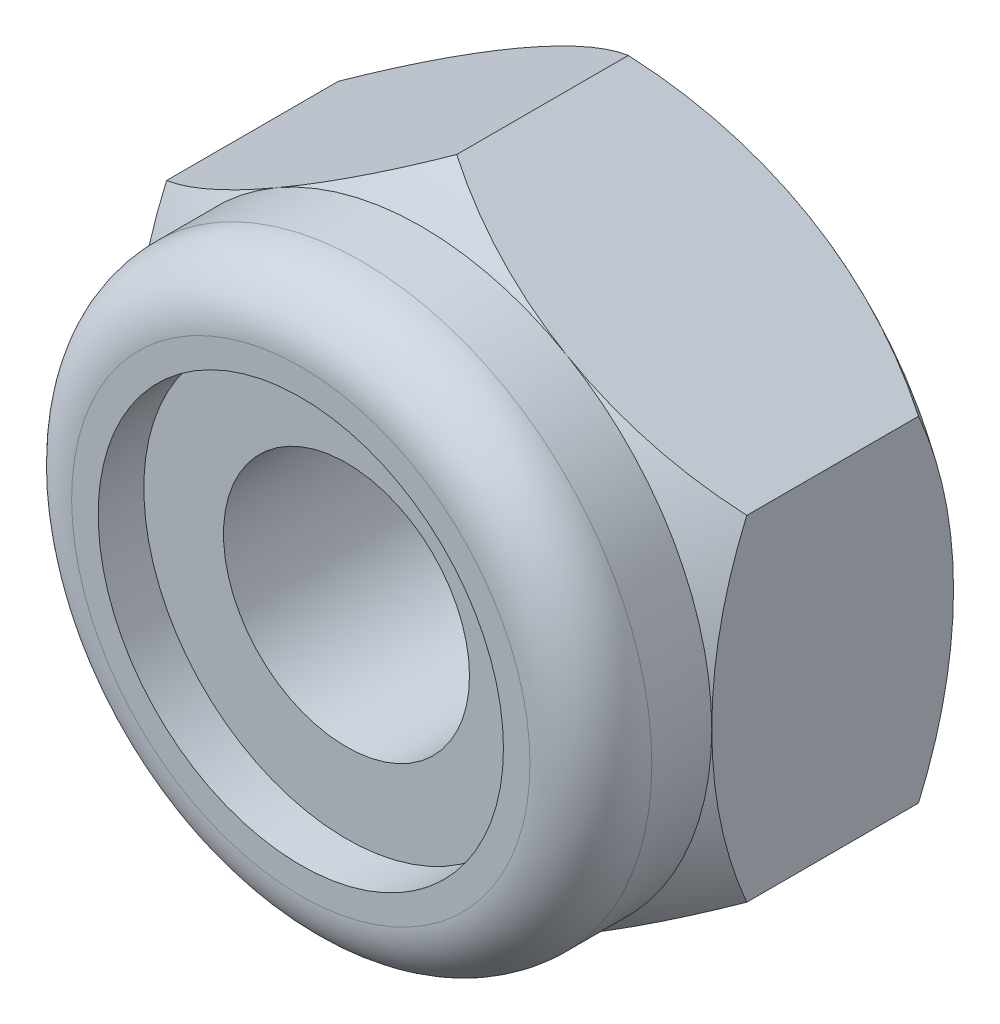
ISO-10303-21;
HEADER;
FILE_DESCRIPTION(('STEP AP214'),'2;1');
FILE_NAME('part.step','',(''),(''),'','','');
FILE_SCHEMA(('AUTOMOTIVE_DESIGN { 1 0 10303 214 1 1 1 1 }'));
ENDSEC;
DATA;
#1=APPLICATION_CONTEXT('core data for automotive mechanical design processes');
#2=APPLICATION_PROTOCOL_DEFINITION('international standard','automotive_design',2000,#1);
#3=PRODUCT_CONTEXT('',#1,'mechanical');
#4=PRODUCT('Part','Part','',(#3));
#5=PRODUCT_RELATED_PRODUCT_CATEGORY('part','',(#4));
#6=PRODUCT_DEFINITION_FORMATION('','',#4);
#7=PRODUCT_DEFINITION_CONTEXT('part definition',#1,'design');
#8=PRODUCT_DEFINITION('design','',#6,#7);
#9=PRODUCT_DEFINITION_SHAPE('','',#8);
#10=(LENGTH_UNIT() NAMED_UNIT(*) SI_UNIT(.MILLI.,.METRE.));
#11=(NAMED_UNIT(*) PLANE_ANGLE_UNIT() SI_UNIT($,.RADIAN.));
#12=(NAMED_UNIT(*) SI_UNIT($,.STERADIAN.) SOLID_ANGLE_UNIT());
#13=UNCERTAINTY_MEASURE_WITH_UNIT(LENGTH_MEASURE(1.E-05),#10,'distance_accuracy_value','');
#14=(GEOMETRIC_REPRESENTATION_CONTEXT(3) GLOBAL_UNCERTAINTY_ASSIGNED_CONTEXT((#13)) GLOBAL_UNIT_ASSIGNED_CONTEXT((#10,
#11,#12)) REPRESENTATION_CONTEXT('',''));
#15=CARTESIAN_POINT('',(0.,0.,0.));
#16=DIRECTION('',(0.,0.,1.));
#17=DIRECTION('',(1.,0.,0.));
#18=AXIS2_PLACEMENT_3D('',#15,#16,#17);
#19=CARTESIAN_POINT('',(0.,1.24344978758018E-11,4.95312499999961));
#20=DIRECTION('',(0.,0.,1.));
#21=DIRECTION('',(1.,0.,0.));
#22=AXIS2_PLACEMENT_3D('',#19,#20,#21);
#23=TOROIDAL_SURFACE('',#22,3.7625,1.);
#24=CARTESIAN_POINT('',(0.,1.24344978758018E-11,4.95312499999961));
#25=DIRECTION('',(0.,0.,-1.));
#26=DIRECTION('',(-1.,0.,0.));
#27=AXIS2_PLACEMENT_3D('',#24,#25,#26);
#28=CIRCLE('',#27,4.7625);
#29=CARTESIAN_POINT('',(-4.7625,1.24344978758018E-11,4.95312499999961));
#30=VERTEX_POINT('',#29);
#31=EDGE_CURVE('E159',#30,#30,#28,.T.);
#32=ORIENTED_EDGE('',*,*,#31,.F.);
#33=EDGE_LOOP('',(#32));
#34=FACE_BOUND('',#33,.T.);
#35=CARTESIAN_POINT('',(0.,1.24344978758018E-11,5.95312499999961));
#36=DIRECTION('',(0.,0.,-1.));
#37=DIRECTION('',(1.,0.,0.));
#38=AXIS2_PLACEMENT_3D('',#35,#36,#37);
#39=CIRCLE('',#38,3.7625);
#40=CARTESIAN_POINT('',(-3.7625,1.24349831420959E-11,5.95312499999961));
#41=VERTEX_POINT('',#40);
#42=CARTESIAN_POINT('',(3.7625,1.24344978758018E-11,5.95312499999961));
#43=VERTEX_POINT('',#42);
#44=EDGE_CURVE('E167',#41,#43,#39,.F.);
#45=ORIENTED_EDGE('',*,*,#44,.F.);
#46=CARTESIAN_POINT('',(0.,1.24344978758018E-11,5.95312499999961));
#47=DIRECTION('',(0.,0.,-1.));
#48=DIRECTION('',(-1.,0.,0.));
#49=AXIS2_PLACEMENT_3D('',#46,#47,#48);
#50=CIRCLE('',#49,3.7625);
#51=EDGE_CURVE('E165',#43,#41,#50,.F.);
#52=ORIENTED_EDGE('',*,*,#51,.F.);
#53=EDGE_LOOP('',(#45,#52));
#54=FACE_BOUND('',#53,.T.);
#55=ADVANCED_FACE('F14',(#34,#54),#23,.T.);
#56=CARTESIAN_POINT('',(0.,1.24344978758018E-11,5.95312499999961));
#57=DIRECTION('',(0.,0.,1.));
#58=DIRECTION('',(1.,0.,0.));
#59=AXIS2_PLACEMENT_3D('',#56,#57,#58);
#60=PLANE('',#59);
#61=CARTESIAN_POINT('',(0.,1.24344978758018E-11,5.95312499999961));
#62=DIRECTION('',(0.,0.,1.));
#63=DIRECTION('',(1.,0.,0.));
#64=AXIS2_PLACEMENT_3D('',#61,#62,#63);
#65=CIRCLE('',#64,3.32676299779793);
#66=CARTESIAN_POINT('',(3.32676299779793,1.24344978758018E-11,5.95312499999961));
#67=VERTEX_POINT('',#66);
#68=EDGE_CURVE('E126',#67,#67,#65,.F.);
#69=ORIENTED_EDGE('',*,*,#68,.T.);
#70=EDGE_LOOP('',(#69));
#71=FACE_BOUND('',#70,.T.);
#72=ORIENTED_EDGE('',*,*,#51,.T.);
#73=ORIENTED_EDGE('',*,*,#44,.T.);
#74=EDGE_LOOP('',(#72,#73));
#75=FACE_BOUND('',#74,.T.);
#76=ADVANCED_FACE('F173',(#71,#75),#60,.T.);
#77=CARTESIAN_POINT('',(0.,1.24344978758018E-11,5.95312499999961));
#78=DIRECTION('',(0.,0.,-1.));
#79=DIRECTION('',(-1.,0.,0.));
#80=AXIS2_PLACEMENT_3D('',#77,#78,#79);
#81=CYLINDRICAL_SURFACE('',#80,4.7625);
#82=ORIENTED_EDGE('',*,*,#31,.T.);
#83=EDGE_LOOP('',(#82));
#84=FACE_BOUND('',#83,.T.);
#85=CARTESIAN_POINT('',(0.,1.24344978758018E-11,3.96875000000001));
#86=DIRECTION('',(0.,0.,-1.));
#87=DIRECTION('',(-1.,0.,0.));
#88=AXIS2_PLACEMENT_3D('',#85,#86,#87);
#89=CIRCLE('',#88,4.7625);
#90=CARTESIAN_POINT('',(2.3812499999973,-4.12444598551874,3.96875));
#91=VERTEX_POINT('',#90);
#92=CARTESIAN_POINT('',(-2.3812499999973,-4.12444598551874,3.96875000000001));
#93=VERTEX_POINT('',#92);
#94=EDGE_CURVE('E108',#91,#93,#89,.T.);
#95=ORIENTED_EDGE('',*,*,#94,.F.);
#96=CARTESIAN_POINT('',(0.,1.24344978758018E-11,3.96875000000001));
#97=DIRECTION('',(0.,0.,-1.));
#98=DIRECTION('',(-1.,0.,0.));
#99=AXIS2_PLACEMENT_3D('',#96,#97,#98);
#100=CIRCLE('',#99,4.7625);
#101=CARTESIAN_POINT('',(4.76249999999073,3.10946746982632E-12,3.96875000000644));
#102=VERTEX_POINT('',#101);
#103=EDGE_CURVE('E149',#102,#91,#100,.T.);
#104=ORIENTED_EDGE('',*,*,#103,.F.);
#105=CARTESIAN_POINT('',(0.,1.24344978758018E-11,3.96875000000001));
#106=DIRECTION('',(0.,0.,-1.));
#107=DIRECTION('',(-1.,0.,0.));
#108=AXIS2_PLACEMENT_3D('',#105,#106,#107);
#109=CIRCLE('',#108,4.7625);
#110=CARTESIAN_POINT('',(2.38125000000269,4.12444598552807,3.96875));
#111=VERTEX_POINT('',#110);
#112=EDGE_CURVE('E151',#111,#102,#109,.T.);
#113=ORIENTED_EDGE('',*,*,#112,.F.);
#114=CARTESIAN_POINT('',(0.,1.24344978758018E-11,3.96874999999923));
#115=DIRECTION('',(0.,0.,-1.));
#116=DIRECTION('',(-1.,0.,0.));
#117=AXIS2_PLACEMENT_3D('',#114,#115,#116);
#118=CIRCLE('',#117,4.7625);
#119=CARTESIAN_POINT('',(-2.38125000000269,4.12444598552807,3.96874999999961));
#120=VERTEX_POINT('',#119);
#121=EDGE_CURVE('E154',#120,#111,#118,.T.);
#122=ORIENTED_EDGE('',*,*,#121,.F.);
#123=CARTESIAN_POINT('',(0.,1.24344978758018E-11,3.96874999999923));
#124=DIRECTION('',(0.,0.,-1.));
#125=DIRECTION('',(-1.,0.,0.));
#126=AXIS2_PLACEMENT_3D('',#123,#124,#125);
#127=CIRCLE('',#126,4.7625);
#128=CARTESIAN_POINT('',(-4.7624999999909,6.21720651084527E-12,3.96875000000634));
#129=VERTEX_POINT('',#128);
#130=EDGE_CURVE('E111',#129,#120,#127,.T.);
#131=ORIENTED_EDGE('',*,*,#130,.F.);
#132=CARTESIAN_POINT('',(0.,1.24344978758018E-11,3.96875000000001));
#133=DIRECTION('',(0.,0.,-1.));
#134=DIRECTION('',(-1.,0.,0.));
#135=AXIS2_PLACEMENT_3D('',#132,#133,#134);
#136=CIRCLE('',#135,4.7625);
#137=EDGE_CURVE('E105',#93,#129,#136,.T.);
#138=ORIENTED_EDGE('',*,*,#137,.F.);
#139=EDGE_LOOP('',(#95,#104,#113,#122,#131,#138));
#140=FACE_BOUND('',#139,.T.);
#141=ADVANCED_FACE('F107',(#84,#140),#81,.T.);
#142=CARTESIAN_POINT('',(0.,1.24344978758018E-11,5.95312499999961));
#143=DIRECTION('',(0.,0.,1.));
#144=DIRECTION('',(1.,0.,0.));
#145=AXIS2_PLACEMENT_3D('',#142,#143,#144);
#146=CYLINDRICAL_SURFACE('',#145,3.32676299779793);
#147=CARTESIAN_POINT('',(0.,1.24344978758018E-11,5.20312499999961));
#148=DIRECTION('',(0.,0.,1.));
#149=DIRECTION('',(1.,0.,0.));
#150=AXIS2_PLACEMENT_3D('',#147,#148,#149);
#151=CIRCLE('',#150,3.32676299779793);
#152=CARTESIAN_POINT('',(3.32676299779793,1.24344978758018E-11,5.20312499999961));
#153=VERTEX_POINT('',#152);
#154=EDGE_CURVE('E146',#153,#153,#151,.F.);
#155=ORIENTED_EDGE('',*,*,#154,.T.);
#156=EDGE_LOOP('',(#155));
#157=FACE_BOUND('',#156,.T.);
#158=ORIENTED_EDGE('',*,*,#68,.F.);
#159=EDGE_LOOP('',(#158));
#160=FACE_BOUND('',#159,.T.);
#161=ADVANCED_FACE('F293',(#157,#160),#146,.F.);
#162=CARTESIAN_POINT('',(0.,0.,-2.89662617308755));
#163=DIRECTION('',(1.,0.,0.));
#164=DIRECTION('',(0.,-0.514062280042827,0.857752861981334));
#165=AXIS2_PLACEMENT_3D('',#162,#163,#164);
#166=SPHERICAL_SURFACE('',#165,8.35552489362568);
#167=CARTESIAN_POINT('',(2.38125000000001,-4.12444598552341,-2.89662617308755));
#168=DIRECTION('',(0.5,-0.866025403784439,0.));
#169=DIRECTION('',(0.866025403784439,0.5,0.));
#170=AXIS2_PLACEMENT_3D('',#167,#168,#169);
#171=CIRCLE('',#170,6.86537617308755);
#172=CARTESIAN_POINT('',(3.73850256307762E-11,-5.4992613140528,3.39407499989474));
#173=VERTEX_POINT('',#172);
#174=EDGE_CURVE('E124',#91,#173,#171,.T.);
#175=ORIENTED_EDGE('',*,*,#174,.F.);
#176=ORIENTED_EDGE('',*,*,#94,.T.);
#177=CARTESIAN_POINT('',(-2.38125000000001,-4.12444598552341,-2.89662617308755));
#178=DIRECTION('',(-0.5,-0.866025403784439,0.));
#179=DIRECTION('',(0.866025403784439,-0.5,0.));
#180=AXIS2_PLACEMENT_3D('',#177,#178,#179);
#181=CIRCLE('',#180,6.86537617308755);
#182=EDGE_CURVE('E122',#173,#93,#181,.T.);
#183=ORIENTED_EDGE('',*,*,#182,.F.);
#184=EDGE_LOOP('',(#175,#176,#183));
#185=FACE_BOUND('',#184,.T.);
#186=ADVANCED_FACE('F120',(#185),#166,.T.);
#187=CARTESIAN_POINT('',(0.,0.,-2.89662617308763));
#188=DIRECTION('',(1.,0.,0.));
#189=DIRECTION('',(0.,0.0032458647859938,0.999994732167021));
#190=AXIS2_PLACEMENT_3D('',#187,#188,#189);
#191=SPHERICAL_SURFACE('',#190,8.35552489362576);
#192=CARTESIAN_POINT('',(-2.38124999999998,-4.12444598552343,-2.89662617308763));
#193=DIRECTION('',(-0.5,-0.866025403784439,0.));
#194=DIRECTION('',(0.866025403784439,-0.5,0.));
#195=AXIS2_PLACEMENT_3D('',#192,#193,#194);
#196=CIRCLE('',#195,6.86537617308764);
#197=CARTESIAN_POINT('',(-4.7625,-2.74963065700324,3.39407499991903));
#198=VERTEX_POINT('',#197);
#199=EDGE_CURVE('E128',#93,#198,#196,.T.);
#200=ORIENTED_EDGE('',*,*,#199,.F.);
#201=ORIENTED_EDGE('',*,*,#137,.T.);
#202=CARTESIAN_POINT('',(-4.7625,0.,-2.89662617308763));
#203=DIRECTION('',(1.,0.,0.));
#204=DIRECTION('',(0.,0.,-1.));
#205=AXIS2_PLACEMENT_3D('',#202,#203,#204);
#206=CIRCLE('',#205,6.86537617308764);
#207=EDGE_CURVE('E131',#198,#129,#206,.F.);
#208=ORIENTED_EDGE('',*,*,#207,.F.);
#209=EDGE_LOOP('',(#200,#201,#208));
#210=FACE_BOUND('',#209,.T.);
#211=ADVANCED_FACE('F129',(#210),#191,.T.);
#212=CARTESIAN_POINT('',(0.,0.,-2.89662617308756));
#213=DIRECTION('',(1.,0.,0.));
#214=DIRECTION('',(0.,0.517754599312731,0.855529178281205));
#215=AXIS2_PLACEMENT_3D('',#212,#213,#214);
#216=SPHERICAL_SURFACE('',#215,8.3555248936257);
#217=CARTESIAN_POINT('',(-4.76249999998179,0.,-2.89662617308756));
#218=DIRECTION('',(1.,0.,0.));
#219=DIRECTION('',(0.,0.,-1.));
#220=AXIS2_PLACEMENT_3D('',#217,#218,#219);
#221=CIRCLE('',#220,6.86537617310022);
#222=CARTESIAN_POINT('',(-4.76249999994811,2.74963065704558,3.39407499993981));
#223=VERTEX_POINT('',#222);
#224=EDGE_CURVE('E282',#129,#223,#221,.F.);
#225=ORIENTED_EDGE('',*,*,#224,.F.);
#226=ORIENTED_EDGE('',*,*,#130,.T.);
#227=CARTESIAN_POINT('',(-2.38125000000002,4.1244459855234,-2.89662617308756));
#228=DIRECTION('',(-0.5,0.866025403784439,0.));
#229=DIRECTION('',(-0.866025403784439,-0.5,0.));
#230=AXIS2_PLACEMENT_3D('',#227,#228,#229);
#231=CIRCLE('',#230,6.86537617308755);
#232=EDGE_CURVE('E278',#223,#120,#231,.T.);
#233=ORIENTED_EDGE('',*,*,#232,.F.);
#234=EDGE_LOOP('',(#225,#226,#233));
#235=FACE_BOUND('',#234,.T.);
#236=ADVANCED_FACE('F397',(#235),#216,.T.);
#237=CARTESIAN_POINT('',(0.,0.,-2.89662617308755));
#238=DIRECTION('',(1.,0.,0.));
#239=DIRECTION('',(0.,0.658959645209424,0.752178294013773));
#240=AXIS2_PLACEMENT_3D('',#237,#238,#239);
#241=SPHERICAL_SURFACE('',#240,8.35552489362569);
#242=ORIENTED_EDGE('',*,*,#121,.T.);
#243=CARTESIAN_POINT('',(2.38125000000002,4.1244459855234,-2.89662617308755));
#244=DIRECTION('',(0.5,0.866025403784439,0.));
#245=DIRECTION('',(-0.866025403784439,0.5,0.));
#246=AXIS2_PLACEMENT_3D('',#243,#244,#245);
#247=CIRCLE('',#246,6.86537617308755);
#248=CARTESIAN_POINT('',(4.83558505737225E-11,5.4992613140033,3.39407499993801));
#249=VERTEX_POINT('',#248);
#250=EDGE_CURVE('E272',#249,#111,#247,.T.);
#251=ORIENTED_EDGE('',*,*,#250,.F.);
#252=CARTESIAN_POINT('',(-2.38125000000002,4.1244459855234,-2.89662617308755));
#253=DIRECTION('',(-0.5,0.866025403784439,0.));
#254=DIRECTION('',(-0.866025403784439,-0.5,0.));
#255=AXIS2_PLACEMENT_3D('',#252,#253,#254);
#256=CIRCLE('',#255,6.86537617308755);
#257=EDGE_CURVE('E276',#120,#249,#256,.T.);
#258=ORIENTED_EDGE('',*,*,#257,.F.);
#259=EDGE_LOOP('',(#242,#251,#258));
#260=FACE_BOUND('',#259,.T.);
#261=ADVANCED_FACE('F354',(#260),#241,.T.);
#262=CARTESIAN_POINT('',(0.,0.,-2.89662617308756));
#263=DIRECTION('',(1.,0.,0.));
#264=DIRECTION('',(0.,0.517754599312728,0.855529178281206));
#265=AXIS2_PLACEMENT_3D('',#262,#263,#264);
#266=SPHERICAL_SURFACE('',#265,8.35552489362569);
#267=ORIENTED_EDGE('',*,*,#112,.T.);
#268=CARTESIAN_POINT('',(4.7625,0.,-2.89662617308756));
#269=DIRECTION('',(1.,0.,0.));
#270=DIRECTION('',(0.,0.,-1.));
#271=AXIS2_PLACEMENT_3D('',#268,#269,#270);
#272=CIRCLE('',#271,6.86537617308757);
#273=CARTESIAN_POINT('',(4.7625,2.74963065695977,3.39407499993803));
#274=VERTEX_POINT('',#273);
#275=EDGE_CURVE('E266',#274,#102,#272,.T.);
#276=ORIENTED_EDGE('',*,*,#275,.F.);
#277=CARTESIAN_POINT('',(2.38125000000001,4.12444598552341,-2.89662617308756));
#278=DIRECTION('',(0.5,0.866025403784439,0.));
#279=DIRECTION('',(-0.866025403784439,0.5,0.));
#280=AXIS2_PLACEMENT_3D('',#277,#278,#279);
#281=CIRCLE('',#280,6.86537617308756);
#282=EDGE_CURVE('E270',#111,#274,#281,.T.);
#283=ORIENTED_EDGE('',*,*,#282,.F.);
#284=EDGE_LOOP('',(#267,#276,#283));
#285=FACE_BOUND('',#284,.T.);
#286=ADVANCED_FACE('F342',(#285),#266,.T.);
#287=CARTESIAN_POINT('',(0.,0.,-2.89662617308763));
#288=DIRECTION('',(1.,0.,0.));
#289=DIRECTION('',(0.,0.00324586478599376,0.999994732167021));
#290=AXIS2_PLACEMENT_3D('',#287,#288,#289);
#291=SPHERICAL_SURFACE('',#290,8.35552489362577);
#292=ORIENTED_EDGE('',*,*,#103,.T.);
#293=CARTESIAN_POINT('',(2.38124999999998,-4.12444598552343,-2.89662617308763));
#294=DIRECTION('',(0.5,-0.866025403784439,0.));
#295=DIRECTION('',(0.866025403784439,0.5,0.));
#296=AXIS2_PLACEMENT_3D('',#293,#294,#295);
#297=CIRCLE('',#296,6.86537617308764);
#298=CARTESIAN_POINT('',(4.76249999998147,-2.74963065704567,3.39407499991452));
#299=VERTEX_POINT('',#298);
#300=EDGE_CURVE('E144',#299,#91,#297,.T.);
#301=ORIENTED_EDGE('',*,*,#300,.F.);
#302=CARTESIAN_POINT('',(4.76249999998147,0.,-2.89662617308763));
#303=DIRECTION('',(1.,0.,0.));
#304=DIRECTION('',(0.,0.,-1.));
#305=AXIS2_PLACEMENT_3D('',#302,#303,#304);
#306=CIRCLE('',#305,6.8653761731005);
#307=EDGE_CURVE('E263',#102,#299,#306,.T.);
#308=ORIENTED_EDGE('',*,*,#307,.F.);
#309=EDGE_LOOP('',(#292,#301,#308));
#310=FACE_BOUND('',#309,.T.);
#311=ADVANCED_FACE('F337',(#310),#291,.T.);
#312=CARTESIAN_POINT('',(2.01930000000006,1.24344978758018E-11,5.20312499999961));
#313=DIRECTION('',(0.,0.,-1.));
#314=DIRECTION('',(-1.,0.,0.));
#315=AXIS2_PLACEMENT_3D('',#312,#313,#314);
#316=PLANE('',#315);
#317=ORIENTED_EDGE('',*,*,#154,.F.);
#318=EDGE_LOOP('',(#317));
#319=FACE_BOUND('',#318,.T.);
#320=CARTESIAN_POINT('',(0.,1.24344978758018E-11,5.20312499999961));
#321=DIRECTION('',(0.,0.,1.));
#322=DIRECTION('',(1.,0.,0.));
#323=AXIS2_PLACEMENT_3D('',#320,#321,#322);
#324=CIRCLE('',#323,2.01930000000001);
#325=CARTESIAN_POINT('',(2.01930000000001,1.24344978758018E-11,5.20312499999961));
#326=VERTEX_POINT('',#325);
#327=EDGE_CURVE('E259',#326,#326,#324,.F.);
#328=ORIENTED_EDGE('',*,*,#327,.T.);
#329=EDGE_LOOP('',(#328));
#330=FACE_BOUND('',#329,.T.);
#331=ADVANCED_FACE('F334',(#319,#330),#316,.F.);
#332=CARTESIAN_POINT('',(2.38125,-4.12444598552342,1.984375));
#333=DIRECTION('',(0.5,-0.866025403784439,0.));
#334=DIRECTION('',(0.866025403784439,0.5,0.));
#335=AXIS2_PLACEMENT_3D('',#332,#333,#334);
#336=PLANE('',#335);
#337=CARTESIAN_POINT('',(2.3812500000054,-4.1244459855203,6.86537617308718));
#338=DIRECTION('',(0.5,-0.866025403784439,0.));
#339=DIRECTION('',(0.866025403784439,0.5,0.));
#340=AXIS2_PLACEMENT_3D('',#337,#338,#339);
#341=CIRCLE('',#340,6.86537617308008);
#342=CARTESIAN_POINT('',(2.38124999999744,-4.12444598551899,3.55054527445553E-12));
#343=VERTEX_POINT('',#342);
#344=CARTESIAN_POINT('',(3.73854593116452E-11,-5.4992613140528,0.57467500011576));
#345=VERTEX_POINT('',#344);
#346=EDGE_CURVE('E250',#343,#345,#341,.F.);
#347=ORIENTED_EDGE('',*,*,#346,.F.);
#348=CARTESIAN_POINT('',(2.38125000000536,-4.12444598552032,6.86537617308723));
#349=DIRECTION('',(0.5,-0.866025403784439,0.));
#350=DIRECTION('',(0.866025403784439,0.5,0.));
#351=AXIS2_PLACEMENT_3D('',#348,#349,#350);
#352=CIRCLE('',#351,6.86537617308013);
#353=CARTESIAN_POINT('',(4.76250000000017,-2.74963065704027,0.574675000102356));
#354=VERTEX_POINT('',#353);
#355=EDGE_CURVE('E253',#354,#343,#352,.F.);
#356=ORIENTED_EDGE('',*,*,#355,.F.);
#357=DIRECTION('',(0.,0.,-1.));
#358=VECTOR('',#357,1.);
#359=CARTESIAN_POINT('',(4.7625,-2.74963065706502,1.984375));
#360=LINE('',#359,#358);
#361=EDGE_CURVE('E262',#299,#354,#360,.T.);
#362=ORIENTED_EDGE('',*,*,#361,.F.);
#363=ORIENTED_EDGE('',*,*,#300,.T.);
#364=ORIENTED_EDGE('',*,*,#174,.T.);
#365=DIRECTION('',(0.,0.,1.));
#366=VECTOR('',#365,1.);
#367=CARTESIAN_POINT('',(7.47700512615523E-11,-5.49926131407438,1.984375));
#368=LINE('',#367,#366);
#369=EDGE_CURVE('E138',#345,#173,#368,.T.);
#370=ORIENTED_EDGE('',*,*,#369,.F.);
#371=EDGE_LOOP('',(#347,#356,#362,#363,#364,#370));
#372=FACE_BOUND('',#371,.T.);
#373=ADVANCED_FACE('F331',(#372),#336,.T.);
#374=CARTESIAN_POINT('',(-2.38125,-4.12444598552342,1.984375));
#375=DIRECTION('',(-0.5,-0.866025403784439,0.));
#376=DIRECTION('',(0.866025403784439,-0.5,0.));
#377=AXIS2_PLACEMENT_3D('',#374,#375,#376);
#378=PLANE('',#377);
#379=CARTESIAN_POINT('',(-2.38125000000538,-4.12444598552031,6.86537617308721));
#380=DIRECTION('',(-0.5,-0.866025403784439,0.));
#381=DIRECTION('',(0.866025403784439,-0.5,0.));
#382=AXIS2_PLACEMENT_3D('',#379,#380,#381);
#383=CIRCLE('',#382,6.86537617308011);
#384=CARTESIAN_POINT('',(-2.38124999999744,-4.12444598551899,3.54924423184855E-12));
#385=VERTEX_POINT('',#384);
#386=CARTESIAN_POINT('',(-4.76249999999733,-2.74963065700014,0.574675000082663));
#387=VERTEX_POINT('',#386);
#388=EDGE_CURVE('E241',#385,#387,#383,.F.);
#389=ORIENTED_EDGE('',*,*,#388,.F.);
#390=CARTESIAN_POINT('',(-2.3812500000054,-4.1244459855203,6.86537617308718));
#391=DIRECTION('',(-0.5,-0.866025403784439,0.));
#392=DIRECTION('',(0.866025403784439,-0.5,0.));
#393=AXIS2_PLACEMENT_3D('',#390,#391,#392);
#394=CIRCLE('',#393,6.86537617308008);
#395=EDGE_CURVE('E247',#345,#385,#394,.F.);
#396=ORIENTED_EDGE('',*,*,#395,.F.);
#397=ORIENTED_EDGE('',*,*,#369,.T.);
#398=ORIENTED_EDGE('',*,*,#182,.T.);
#399=ORIENTED_EDGE('',*,*,#199,.T.);
#400=DIRECTION('',(0.,0.,1.));
#401=VECTOR('',#400,1.);
#402=CARTESIAN_POINT('',(-4.7625,-2.74963065699085,1.984375));
#403=LINE('',#402,#401);
#404=EDGE_CURVE('E134',#387,#198,#403,.T.);
#405=ORIENTED_EDGE('',*,*,#404,.F.);
#406=EDGE_LOOP('',(#389,#396,#397,#398,#399,#405));
#407=FACE_BOUND('',#406,.T.);
#408=ADVANCED_FACE('F136',(#407),#378,.T.);
#409=CARTESIAN_POINT('',(-4.7625,0.,1.984375));
#410=DIRECTION('',(-1.,0.,0.));
#411=DIRECTION('',(0.,0.,1.));
#412=AXIS2_PLACEMENT_3D('',#409,#410,#411);
#413=PLANE('',#412);
#414=CARTESIAN_POINT('',(-4.7625000000002,1.24373023356119E-11,6.86537617308717));
#415=DIRECTION('',(1.,0.,0.));
#416=DIRECTION('',(0.,0.,-1.));
#417=AXIS2_PLACEMENT_3D('',#414,#415,#416);
#418=CIRCLE('',#417,6.86537617308743);
#419=CARTESIAN_POINT('',(-4.7624999999964,6.210826019676E-12,-2.87747256577653E-12));
#420=VERTEX_POINT('',#419);
#421=CARTESIAN_POINT('',(-4.7624999999573,2.74963065704027,0.574675000059021));
#422=VERTEX_POINT('',#421);
#423=EDGE_CURVE('E238',#420,#422,#418,.T.);
#424=ORIENTED_EDGE('',*,*,#423,.F.);
#425=CARTESIAN_POINT('',(-4.76249999998394,1.24086938640966E-11,6.86537617308721));
#426=DIRECTION('',(1.,0.,0.));
#427=DIRECTION('',(0.,0.,-1.));
#428=AXIS2_PLACEMENT_3D('',#425,#426,#427);
#429=CIRCLE('',#428,6.86537617309872);
#430=EDGE_CURVE('E244',#387,#420,#429,.T.);
#431=ORIENTED_EDGE('',*,*,#430,.F.);
#432=ORIENTED_EDGE('',*,*,#404,.T.);
#433=ORIENTED_EDGE('',*,*,#207,.T.);
#434=ORIENTED_EDGE('',*,*,#224,.T.);
#435=DIRECTION('',(0.,0.,1.));
#436=VECTOR('',#435,1.);
#437=CARTESIAN_POINT('',(-4.76249999991442,2.74963065706503,1.98437499999923));
#438=LINE('',#437,#436);
#439=EDGE_CURVE('E281',#422,#223,#438,.T.);
#440=ORIENTED_EDGE('',*,*,#439,.F.);
#441=EDGE_LOOP('',(#424,#431,#432,#433,#434,#440));
#442=FACE_BOUND('',#441,.T.);
#443=ADVANCED_FACE('F325',(#442),#413,.T.);
#444=CARTESIAN_POINT('',(-2.38125,4.12444598552342,1.98437499999923));
#445=DIRECTION('',(-0.5,0.866025403784439,0.));
#446=DIRECTION('',(-0.866025403784439,-0.5,0.));
#447=AXIS2_PLACEMENT_3D('',#444,#445,#446);
#448=PLANE('',#447);
#449=CARTESIAN_POINT('',(-2.38124999999462,4.12444598552652,6.86537617308721));
#450=DIRECTION('',(-0.5,0.866025403784439,0.));
#451=DIRECTION('',(-0.866025403784439,-0.5,0.));
#452=AXIS2_PLACEMENT_3D('',#449,#450,#451);
#453=CIRCLE('',#452,6.86537617309504);
#454=CARTESIAN_POINT('',(-2.38125000000283,4.12444598552831,-3.91830665136261E-12));
#455=VERTEX_POINT('',#454);
#456=CARTESIAN_POINT('',(4.83562842545915E-11,5.4992613140033,0.574675000050742));
#457=VERTEX_POINT('',#456);
#458=EDGE_CURVE('E232',#455,#457,#453,.F.);
#459=ORIENTED_EDGE('',*,*,#458,.F.);
#460=CARTESIAN_POINT('',(-2.38124999999463,4.12444598552652,6.86537617308718));
#461=DIRECTION('',(-0.5,0.866025403784439,0.));
#462=DIRECTION('',(-0.866025403784439,-0.5,0.));
#463=AXIS2_PLACEMENT_3D('',#460,#461,#462);
#464=CIRCLE('',#463,6.86537617309502);
#465=EDGE_CURVE('E235',#422,#455,#464,.F.);
#466=ORIENTED_EDGE('',*,*,#465,.F.);
#467=ORIENTED_EDGE('',*,*,#439,.T.);
#468=ORIENTED_EDGE('',*,*,#232,.T.);
#469=ORIENTED_EDGE('',*,*,#257,.T.);
#470=DIRECTION('',(0.,0.,1.));
#471=VECTOR('',#470,1.);
#472=CARTESIAN_POINT('',(9.6712134828314E-11,5.49926131397538,1.98437499999923));
#473=LINE('',#472,#471);
#474=EDGE_CURVE('E275',#457,#249,#473,.T.);
#475=ORIENTED_EDGE('',*,*,#474,.F.);
#476=EDGE_LOOP('',(#459,#466,#467,#468,#469,#475));
#477=FACE_BOUND('',#476,.T.);
#478=ADVANCED_FACE('F322',(#477),#448,.T.);
#479=CARTESIAN_POINT('',(2.38125,4.12444598552342,1.98437499999923));
#480=DIRECTION('',(0.5,0.866025403784439,0.));
#481=DIRECTION('',(-0.866025403784439,0.5,0.));
#482=AXIS2_PLACEMENT_3D('',#479,#480,#481);
#483=PLANE('',#482);
#484=CARTESIAN_POINT('',(2.38124999999461,4.12444598552653,6.86537617308722));
#485=DIRECTION('',(0.5,0.866025403784439,0.));
#486=DIRECTION('',(-0.866025403784439,0.5,0.));
#487=AXIS2_PLACEMENT_3D('',#484,#485,#486);
#488=CIRCLE('',#487,6.86537617309507);
#489=CARTESIAN_POINT('',(2.38125000000283,4.12444598552832,-3.92437818352853E-12));
#490=VERTEX_POINT('',#489);
#491=CARTESIAN_POINT('',(4.76250000000939,2.74963065695706,0.574675000062079));
#492=VERTEX_POINT('',#491);
#493=EDGE_CURVE('E35',#490,#492,#488,.F.);
#494=ORIENTED_EDGE('',*,*,#493,.F.);
#495=CARTESIAN_POINT('',(2.38124999999462,4.12444598552652,6.86537617308721));
#496=DIRECTION('',(0.5,0.866025403784439,0.));
#497=DIRECTION('',(-0.866025403784439,0.5,0.));
#498=AXIS2_PLACEMENT_3D('',#495,#496,#497);
#499=CIRCLE('',#498,6.86537617309504);
#500=EDGE_CURVE('E230',#457,#490,#499,.F.);
#501=ORIENTED_EDGE('',*,*,#500,.F.);
#502=ORIENTED_EDGE('',*,*,#474,.T.);
#503=ORIENTED_EDGE('',*,*,#250,.T.);
#504=ORIENTED_EDGE('',*,*,#282,.T.);
#505=DIRECTION('',(0.,0.,-1.));
#506=VECTOR('',#505,1.);
#507=CARTESIAN_POINT('',(4.7625,2.74963065690392,1.984375));
#508=LINE('',#507,#506);
#509=EDGE_CURVE('E269',#492,#274,#508,.F.);
#510=ORIENTED_EDGE('',*,*,#509,.F.);
#511=EDGE_LOOP('',(#494,#501,#502,#503,#504,#510));
#512=FACE_BOUND('',#511,.T.);
#513=ADVANCED_FACE('F318',(#512),#483,.T.);
#514=CARTESIAN_POINT('',(4.7625,0.,1.984375));
#515=DIRECTION('',(1.,0.,0.));
#516=DIRECTION('',(0.,0.,-1.));
#517=AXIS2_PLACEMENT_3D('',#514,#515,#516);
#518=PLANE('',#517);
#519=CARTESIAN_POINT('',(4.76250000000017,1.23976350019372E-11,6.86537617308723));
#520=DIRECTION('',(1.,0.,0.));
#521=DIRECTION('',(0.,0.,-1.));
#522=AXIS2_PLACEMENT_3D('',#519,#520,#521);
#523=CIRCLE('',#522,6.86537617308747);
#524=CARTESIAN_POINT('',(4.76250000000257,6.21704829444962E-12,1.41141438814163E-12));
#525=VERTEX_POINT('',#524);
#526=EDGE_CURVE('E256',#525,#354,#523,.F.);
#527=ORIENTED_EDGE('',*,*,#526,.F.);
#528=CARTESIAN_POINT('',(4.76250000000939,1.24345673325034E-11,6.86537617308722));
#529=DIRECTION('',(1.,0.,0.));
#530=DIRECTION('',(0.,0.,-1.));
#531=AXIS2_PLACEMENT_3D('',#528,#529,#530);
#532=CIRCLE('',#531,6.8653761730811);
#533=EDGE_CURVE('E226',#492,#525,#532,.F.);
#534=ORIENTED_EDGE('',*,*,#533,.F.);
#535=ORIENTED_EDGE('',*,*,#509,.T.);
#536=ORIENTED_EDGE('',*,*,#275,.T.);
#537=ORIENTED_EDGE('',*,*,#307,.T.);
#538=ORIENTED_EDGE('',*,*,#361,.T.);
#539=EDGE_LOOP('',(#527,#534,#535,#536,#537,#538));
#540=FACE_BOUND('',#539,.T.);
#541=ADVANCED_FACE('F314',(#540),#518,.T.);
#542=CARTESIAN_POINT('',(0.,1.24344978758018E-11,5.95312499999961));
#543=DIRECTION('',(0.,0.,1.));
#544=DIRECTION('',(1.,0.,0.));
#545=AXIS2_PLACEMENT_3D('',#542,#543,#544);
#546=CYLINDRICAL_SURFACE('',#545,2.01930000000001);
#547=CARTESIAN_POINT('',(0.,1.24344978758018E-11,0.));
#548=DIRECTION('',(0.,0.,1.));
#549=DIRECTION('',(1.,0.,0.));
#550=AXIS2_PLACEMENT_3D('',#547,#548,#549);
#551=CIRCLE('',#550,2.01930000000001);
#552=CARTESIAN_POINT('',(2.01930000000001,1.24344978758018E-11,0.));
#553=VERTEX_POINT('',#552);
#554=EDGE_CURVE('E223',#553,#553,#551,.T.);
#555=ORIENTED_EDGE('',*,*,#554,.F.);
#556=EDGE_LOOP('',(#555));
#557=FACE_BOUND('',#556,.T.);
#558=ORIENTED_EDGE('',*,*,#327,.F.);
#559=EDGE_LOOP('',(#558));
#560=FACE_BOUND('',#559,.T.);
#561=ADVANCED_FACE('F310',(#557,#560),#546,.F.);
#562=CARTESIAN_POINT('',(0.,1.23976350019372E-11,6.86537617308723));
#563=DIRECTION('',(1.,0.,0.));
#564=DIRECTION('',(0.,-0.517754599313837,-0.855529178280535));
#565=AXIS2_PLACEMENT_3D('',#562,#563,#564);
#566=SPHERICAL_SURFACE('',#565,8.35552489362571);
#567=ORIENTED_EDGE('',*,*,#355,.T.);
#568=CARTESIAN_POINT('',(0.,1.23976350019372E-11,0.));
#569=DIRECTION('',(0.,0.,-1.));
#570=DIRECTION('',(-1.,0.,0.));
#571=AXIS2_PLACEMENT_3D('',#568,#569,#570);
#572=CIRCLE('',#571,4.76250000000054);
#573=EDGE_CURVE('E220',#525,#343,#572,.T.);
#574=ORIENTED_EDGE('',*,*,#573,.F.);
#575=ORIENTED_EDGE('',*,*,#526,.T.);
#576=EDGE_LOOP('',(#567,#574,#575));
#577=FACE_BOUND('',#576,.T.);
#578=ADVANCED_FACE('F313',(#577),#566,.T.);
#579=CARTESIAN_POINT('',(0.,1.24336305140638E-11,6.86537617308718));
#580=DIRECTION('',(1.,0.,0.));
#581=DIRECTION('',(0.,-0.658959645215233,-0.752178294008684));
#582=AXIS2_PLACEMENT_3D('',#579,#580,#581);
#583=SPHERICAL_SURFACE('',#582,8.35552489362568);
#584=ORIENTED_EDGE('',*,*,#395,.T.);
#585=CARTESIAN_POINT('',(0.,1.24336305140638E-11,0.));
#586=DIRECTION('',(0.,0.,-1.));
#587=DIRECTION('',(-1.,0.,0.));
#588=AXIS2_PLACEMENT_3D('',#585,#586,#587);
#589=CIRCLE('',#588,4.76250000000056);
#590=EDGE_CURVE('E217',#343,#385,#589,.T.);
#591=ORIENTED_EDGE('',*,*,#590,.F.);
#592=ORIENTED_EDGE('',*,*,#346,.T.);
#593=EDGE_LOOP('',(#584,#591,#592));
#594=FACE_BOUND('',#593,.T.);
#595=ADVANCED_FACE('F361',(#594),#583,.T.);
#596=CARTESIAN_POINT('',(0.,1.24086938640966E-11,6.86537617308721));
#597=DIRECTION('',(1.,0.,0.));
#598=DIRECTION('',(0.,-0.517754599313839,-0.855529178280534));
#599=AXIS2_PLACEMENT_3D('',#596,#597,#598);
#600=SPHERICAL_SURFACE('',#599,8.3555248936257);
#601=CARTESIAN_POINT('',(0.,1.24086938640966E-11,0.));
#602=DIRECTION('',(0.,0.,-1.));
#603=DIRECTION('',(-1.,0.,0.));
#604=AXIS2_PLACEMENT_3D('',#601,#602,#603);
#605=CIRCLE('',#604,4.76250000000054);
#606=EDGE_CURVE('E214',#385,#420,#605,.T.);
#607=ORIENTED_EDGE('',*,*,#606,.F.);
#608=ORIENTED_EDGE('',*,*,#388,.T.);
#609=ORIENTED_EDGE('',*,*,#430,.T.);
#610=EDGE_LOOP('',(#607,#608,#609));
#611=FACE_BOUND('',#610,.T.);
#612=ADVANCED_FACE('F365',(#611),#600,.T.);
#613=CARTESIAN_POINT('',(0.,1.24345453096468E-11,6.86537617308718));
#614=DIRECTION('',(1.,0.,0.));
#615=DIRECTION('',(0.,-0.00324586478780732,-0.999994732167015));
#616=AXIS2_PLACEMENT_3D('',#613,#614,#615);
#617=SPHERICAL_SURFACE('',#616,8.35552489362568);
#618=ORIENTED_EDGE('',*,*,#465,.T.);
#619=CARTESIAN_POINT('',(0.,1.24345453096468E-11,0.));
#620=DIRECTION('',(0.,0.,-1.));
#621=DIRECTION('',(-1.,0.,0.));
#622=AXIS2_PLACEMENT_3D('',#619,#620,#621);
#623=CIRCLE('',#622,4.76250000000056);
#624=EDGE_CURVE('E211',#420,#455,#623,.T.);
#625=ORIENTED_EDGE('',*,*,#624,.F.);
#626=ORIENTED_EDGE('',*,*,#423,.T.);
#627=EDGE_LOOP('',(#618,#625,#626));
#628=FACE_BOUND('',#627,.T.);
#629=ADVANCED_FACE('F369',(#628),#617,.T.);
#630=CARTESIAN_POINT('',(0.,1.24453398975266E-11,6.86537617308721));
#631=DIRECTION('',(1.,0.,0.));
#632=DIRECTION('',(0.,0.514062280041625,-0.857752861982054));
#633=AXIS2_PLACEMENT_3D('',#630,#631,#632);
#634=SPHERICAL_SURFACE('',#633,8.3555248936257);
#635=ORIENTED_EDGE('',*,*,#500,.T.);
#636=CARTESIAN_POINT('',(0.,1.24453398975266E-11,0.));
#637=DIRECTION('',(0.,0.,-1.));
#638=DIRECTION('',(-1.,0.,0.));
#639=AXIS2_PLACEMENT_3D('',#636,#637,#638);
#640=CIRCLE('',#639,4.76250000000055);
#641=EDGE_CURVE('E26',#455,#490,#640,.T.);
#642=ORIENTED_EDGE('',*,*,#641,.F.);
#643=ORIENTED_EDGE('',*,*,#458,.T.);
#644=EDGE_LOOP('',(#635,#642,#643));
#645=FACE_BOUND('',#644,.T.);
#646=ADVANCED_FACE('F306',(#645),#634,.T.);
#647=CARTESIAN_POINT('',(0.,1.24345673325034E-11,6.86537617308722));
#648=DIRECTION('',(1.,0.,0.));
#649=DIRECTION('',(0.,-0.00324586478780731,-0.999994732167015));
#650=AXIS2_PLACEMENT_3D('',#647,#648,#649);
#651=SPHERICAL_SURFACE('',#650,8.35552489362573);
#652=ORIENTED_EDGE('',*,*,#533,.T.);
#653=CARTESIAN_POINT('',(0.,1.24345673325034E-11,0.));
#654=DIRECTION('',(0.,0.,-1.));
#655=DIRECTION('',(-1.,0.,0.));
#656=AXIS2_PLACEMENT_3D('',#653,#654,#655);
#657=CIRCLE('',#656,4.76250000000058);
#658=EDGE_CURVE('E9',#490,#525,#657,.T.);
#659=ORIENTED_EDGE('',*,*,#658,.F.);
#660=ORIENTED_EDGE('',*,*,#493,.T.);
#661=EDGE_LOOP('',(#652,#659,#660));
#662=FACE_BOUND('',#661,.T.);
#663=ADVANCED_FACE('F16',(#662),#651,.T.);
#664=CARTESIAN_POINT('',(0.,0.,0.));
#665=DIRECTION('',(0.,0.,-1.));
#666=DIRECTION('',(-1.,0.,0.));
#667=AXIS2_PLACEMENT_3D('',#664,#665,#666);
#668=PLANE('',#667);
#669=ORIENTED_EDGE('',*,*,#641,.T.);
#670=ORIENTED_EDGE('',*,*,#658,.T.);
#671=ORIENTED_EDGE('',*,*,#573,.T.);
#672=ORIENTED_EDGE('',*,*,#590,.T.);
#673=ORIENTED_EDGE('',*,*,#606,.T.);
#674=ORIENTED_EDGE('',*,*,#624,.T.);
#675=EDGE_LOOP('',(#669,#670,#671,#672,#673,#674));
#676=FACE_BOUND('',#675,.T.);
#677=ORIENTED_EDGE('',*,*,#554,.T.);
#678=EDGE_LOOP('',(#677));
#679=FACE_BOUND('',#678,.T.);
#680=ADVANCED_FACE('F299',(#676,#679),#668,.T.);
#681=CLOSED_SHELL('',(#55,#76,#141,#161,#186,#211,#236,#261,#286,#311,#331,#373,#408,#443,#478,
#513,#541,#561,#578,#595,#612,#629,#646,#663,#680));
#682=MANIFOLD_SOLID_BREP('B1',#681);
#683=ADVANCED_BREP_SHAPE_REPRESENTATION('',(#18,#682),#14);
#684=SHAPE_DEFINITION_REPRESENTATION(#9,#683);
ENDSEC;
END-ISO-10303-21;
